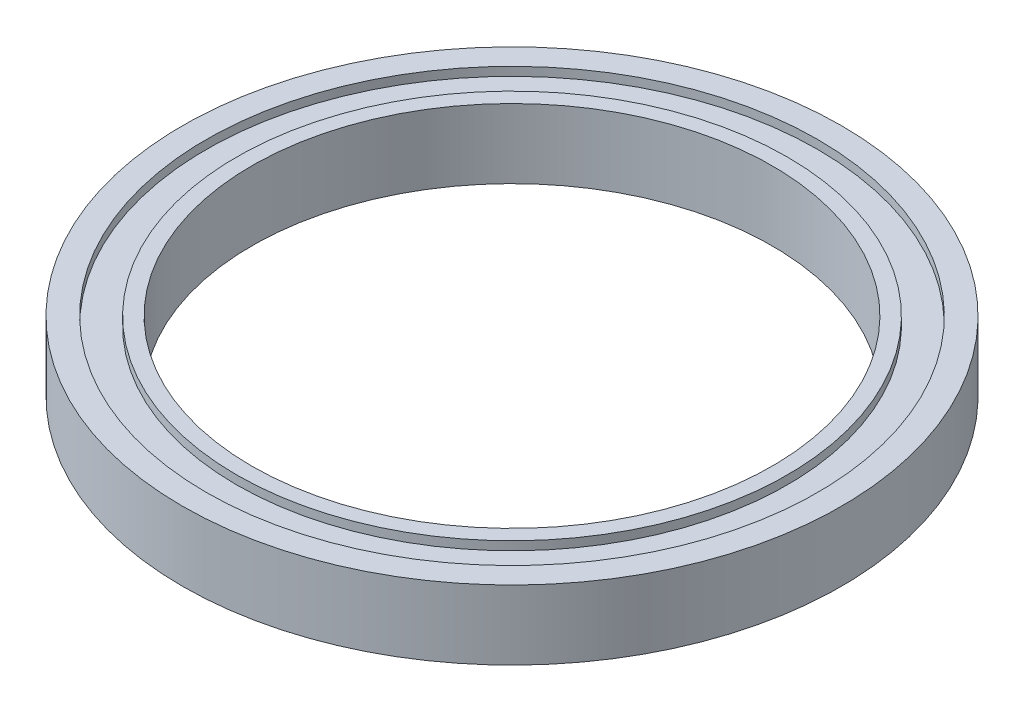
ISO-10303-21;
HEADER;
FILE_DESCRIPTION(('STEP AP214'),'2;1');
FILE_NAME('part.step','',(''),(''),'','','');
FILE_SCHEMA(('AUTOMOTIVE_DESIGN { 1 0 10303 214 1 1 1 1 }'));
ENDSEC;
DATA;
#1=APPLICATION_CONTEXT('core data for automotive mechanical design processes');
#2=APPLICATION_PROTOCOL_DEFINITION('international standard','automotive_design',2000,#1);
#3=PRODUCT_CONTEXT('',#1,'mechanical');
#4=PRODUCT('Part','Part','',(#3));
#5=PRODUCT_RELATED_PRODUCT_CATEGORY('part','',(#4));
#6=PRODUCT_DEFINITION_FORMATION('','',#4);
#7=PRODUCT_DEFINITION_CONTEXT('part definition',#1,'design');
#8=PRODUCT_DEFINITION('design','',#6,#7);
#9=PRODUCT_DEFINITION_SHAPE('','',#8);
#10=(LENGTH_UNIT() NAMED_UNIT(*) SI_UNIT(.MILLI.,.METRE.));
#11=(NAMED_UNIT(*) PLANE_ANGLE_UNIT() SI_UNIT($,.RADIAN.));
#12=(NAMED_UNIT(*) SI_UNIT($,.STERADIAN.) SOLID_ANGLE_UNIT());
#13=UNCERTAINTY_MEASURE_WITH_UNIT(LENGTH_MEASURE(1.E-05),#10,'distance_accuracy_value','');
#14=(GEOMETRIC_REPRESENTATION_CONTEXT(3) GLOBAL_UNCERTAINTY_ASSIGNED_CONTEXT((#13)) GLOBAL_UNIT_ASSIGNED_CONTEXT((#10,
#11,#12)) REPRESENTATION_CONTEXT('',''));
#15=CARTESIAN_POINT('',(0.,0.,0.));
#16=DIRECTION('',(0.,0.,1.));
#17=DIRECTION('',(1.,0.,0.));
#18=AXIS2_PLACEMENT_3D('',#15,#16,#17);
#19=CARTESIAN_POINT('',(0.,0.,0.));
#20=DIRECTION('',(0.,1.,0.));
#21=DIRECTION('',(0.,0.,1.));
#22=AXIS2_PLACEMENT_3D('',#19,#20,#21);
#23=PLANE('',#22);
#24=CARTESIAN_POINT('',(0.,0.,0.));
#25=DIRECTION('',(0.,1.,0.));
#26=DIRECTION('',(0.,0.,1.));
#27=AXIS2_PLACEMENT_3D('',#24,#25,#26);
#28=CIRCLE('',#27,30.);
#29=CARTESIAN_POINT('',(0.,0.,30.));
#30=VERTEX_POINT('',#29);
#31=EDGE_CURVE('E47',#30,#30,#28,.T.);
#32=ORIENTED_EDGE('',*,*,#31,.T.);
#33=EDGE_LOOP('',(#32));
#34=FACE_BOUND('',#33,.T.);
#35=CARTESIAN_POINT('',(0.,0.,0.));
#36=DIRECTION('',(0.,-1.,0.));
#37=DIRECTION('',(0.,0.,-1.));
#38=AXIS2_PLACEMENT_3D('',#35,#36,#37);
#39=CIRCLE('',#38,31.75);
#40=CARTESIAN_POINT('',(0.,0.,-31.75));
#41=VERTEX_POINT('',#40);
#42=EDGE_CURVE('E71',#41,#41,#39,.T.);
#43=ORIENTED_EDGE('',*,*,#42,.T.);
#44=EDGE_LOOP('',(#43));
#45=FACE_BOUND('',#44,.T.);
#46=ADVANCED_FACE('F34',(#34,#45),#23,.F.);
#47=CARTESIAN_POINT('',(0.,8.,0.));
#48=DIRECTION('',(0.,1.,0.));
#49=DIRECTION('',(0.,0.,1.));
#50=AXIS2_PLACEMENT_3D('',#47,#48,#49);
#51=PLANE('',#50);
#52=CARTESIAN_POINT('',(0.,8.,0.));
#53=DIRECTION('',(0.,1.,0.));
#54=DIRECTION('',(0.,0.,1.));
#55=AXIS2_PLACEMENT_3D('',#52,#53,#54);
#56=CIRCLE('',#55,30.);
#57=CARTESIAN_POINT('',(0.,8.,30.));
#58=VERTEX_POINT('',#57);
#59=EDGE_CURVE('E45',#58,#58,#56,.T.);
#60=ORIENTED_EDGE('',*,*,#59,.F.);
#61=EDGE_LOOP('',(#60));
#62=FACE_BOUND('',#61,.T.);
#63=CARTESIAN_POINT('',(0.,8.,0.));
#64=DIRECTION('',(0.,1.,0.));
#65=DIRECTION('',(0.,0.,1.));
#66=AXIS2_PLACEMENT_3D('',#63,#64,#65);
#67=CIRCLE('',#66,31.75);
#68=CARTESIAN_POINT('',(0.,8.,31.75));
#69=VERTEX_POINT('',#68);
#70=EDGE_CURVE('E59',#69,#69,#67,.T.);
#71=ORIENTED_EDGE('',*,*,#70,.T.);
#72=EDGE_LOOP('',(#71));
#73=FACE_BOUND('',#72,.T.);
#74=ADVANCED_FACE('F109',(#62,#73),#51,.T.);
#75=CARTESIAN_POINT('',(0.,8.,0.));
#76=DIRECTION('',(0.,1.,0.));
#77=DIRECTION('',(0.,0.,1.));
#78=AXIS2_PLACEMENT_3D('',#75,#76,#77);
#79=CIRCLE('',#78,35.25);
#80=CARTESIAN_POINT('',(0.,8.,35.25));
#81=VERTEX_POINT('',#80);
#82=EDGE_CURVE('E53',#81,#81,#79,.T.);
#83=ORIENTED_EDGE('',*,*,#82,.F.);
#84=EDGE_LOOP('',(#83));
#85=FACE_BOUND('',#84,.T.);
#86=CARTESIAN_POINT('',(0.,8.,0.));
#87=DIRECTION('',(0.,1.,0.));
#88=DIRECTION('',(0.,0.,1.));
#89=AXIS2_PLACEMENT_3D('',#86,#87,#88);
#90=CIRCLE('',#89,38.);
#91=CARTESIAN_POINT('',(0.,8.,38.));
#92=VERTEX_POINT('',#91);
#93=EDGE_CURVE('E10',#92,#92,#90,.T.);
#94=ORIENTED_EDGE('',*,*,#93,.T.);
#95=EDGE_LOOP('',(#94));
#96=FACE_BOUND('',#95,.T.);
#97=ADVANCED_FACE('F96',(#85,#96),#51,.T.);
#98=CARTESIAN_POINT('',(0.,0.,0.));
#99=DIRECTION('',(0.,-1.,0.));
#100=DIRECTION('',(0.,0.,-1.));
#101=AXIS2_PLACEMENT_3D('',#98,#99,#100);
#102=CIRCLE('',#101,35.25);
#103=CARTESIAN_POINT('',(0.,0.,-35.25));
#104=VERTEX_POINT('',#103);
#105=EDGE_CURVE('E65',#104,#104,#102,.T.);
#106=ORIENTED_EDGE('',*,*,#105,.F.);
#107=EDGE_LOOP('',(#106));
#108=FACE_BOUND('',#107,.T.);
#109=CARTESIAN_POINT('',(0.,0.,0.));
#110=DIRECTION('',(0.,1.,0.));
#111=DIRECTION('',(0.,0.,1.));
#112=AXIS2_PLACEMENT_3D('',#109,#110,#111);
#113=CIRCLE('',#112,38.);
#114=CARTESIAN_POINT('',(0.,0.,38.));
#115=VERTEX_POINT('',#114);
#116=EDGE_CURVE('E38',#115,#115,#113,.T.);
#117=ORIENTED_EDGE('',*,*,#116,.F.);
#118=EDGE_LOOP('',(#117));
#119=FACE_BOUND('',#118,.T.);
#120=ADVANCED_FACE('F93',(#108,#119),#23,.F.);
#121=CARTESIAN_POINT('',(0.,8.,0.));
#122=DIRECTION('',(0.,-1.,0.));
#123=DIRECTION('',(0.,0.,-1.));
#124=AXIS2_PLACEMENT_3D('',#121,#122,#123);
#125=CYLINDRICAL_SURFACE('',#124,38.);
#126=ORIENTED_EDGE('',*,*,#93,.F.);
#127=EDGE_LOOP('',(#126));
#128=FACE_BOUND('',#127,.T.);
#129=ORIENTED_EDGE('',*,*,#116,.T.);
#130=EDGE_LOOP('',(#129));
#131=FACE_BOUND('',#130,.T.);
#132=ADVANCED_FACE('F36',(#128,#131),#125,.T.);
#133=CARTESIAN_POINT('',(0.,8.,0.));
#134=DIRECTION('',(0.,-1.,0.));
#135=DIRECTION('',(0.,0.,-1.));
#136=AXIS2_PLACEMENT_3D('',#133,#134,#135);
#137=CYLINDRICAL_SURFACE('',#136,30.);
#138=ORIENTED_EDGE('',*,*,#59,.T.);
#139=EDGE_LOOP('',(#138));
#140=FACE_BOUND('',#139,.T.);
#141=ORIENTED_EDGE('',*,*,#31,.F.);
#142=EDGE_LOOP('',(#141));
#143=FACE_BOUND('',#142,.T.);
#144=ADVANCED_FACE('F100',(#140,#143),#137,.F.);
#145=CARTESIAN_POINT('',(0.,7.,0.));
#146=DIRECTION('',(0.,1.,0.));
#147=DIRECTION('',(0.,0.,1.));
#148=AXIS2_PLACEMENT_3D('',#145,#146,#147);
#149=CYLINDRICAL_SURFACE('',#148,35.25);
#150=CARTESIAN_POINT('',(0.,7.,0.));
#151=DIRECTION('',(0.,1.,0.));
#152=DIRECTION('',(0.,0.,1.));
#153=AXIS2_PLACEMENT_3D('',#150,#151,#152);
#154=CIRCLE('',#153,35.25);
#155=CARTESIAN_POINT('',(0.,7.,35.25));
#156=VERTEX_POINT('',#155);
#157=EDGE_CURVE('E50',#156,#156,#154,.T.);
#158=ORIENTED_EDGE('',*,*,#157,.F.);
#159=EDGE_LOOP('',(#158));
#160=FACE_BOUND('',#159,.T.);
#161=ORIENTED_EDGE('',*,*,#82,.T.);
#162=EDGE_LOOP('',(#161));
#163=FACE_BOUND('',#162,.T.);
#164=ADVANCED_FACE('F105',(#160,#163),#149,.F.);
#165=CARTESIAN_POINT('',(0.,7.,0.));
#166=DIRECTION('',(0.,1.,0.));
#167=DIRECTION('',(0.,0.,1.));
#168=AXIS2_PLACEMENT_3D('',#165,#166,#167);
#169=PLANE('',#168);
#170=CARTESIAN_POINT('',(0.,7.,0.));
#171=DIRECTION('',(0.,1.,0.));
#172=DIRECTION('',(0.,0.,1.));
#173=AXIS2_PLACEMENT_3D('',#170,#171,#172);
#174=CIRCLE('',#173,31.75);
#175=CARTESIAN_POINT('',(0.,7.,31.75));
#176=VERTEX_POINT('',#175);
#177=EDGE_CURVE('E56',#176,#176,#174,.T.);
#178=ORIENTED_EDGE('',*,*,#177,.F.);
#179=EDGE_LOOP('',(#178));
#180=FACE_BOUND('',#179,.T.);
#181=ORIENTED_EDGE('',*,*,#157,.T.);
#182=EDGE_LOOP('',(#181));
#183=FACE_BOUND('',#182,.T.);
#184=ADVANCED_FACE('F122',(#180,#183),#169,.T.);
#185=CARTESIAN_POINT('',(0.,7.,0.));
#186=DIRECTION('',(0.,1.,0.));
#187=DIRECTION('',(0.,0.,1.));
#188=AXIS2_PLACEMENT_3D('',#185,#186,#187);
#189=CYLINDRICAL_SURFACE('',#188,31.75);
#190=ORIENTED_EDGE('',*,*,#177,.T.);
#191=EDGE_LOOP('',(#190));
#192=FACE_BOUND('',#191,.T.);
#193=ORIENTED_EDGE('',*,*,#70,.F.);
#194=EDGE_LOOP('',(#193));
#195=FACE_BOUND('',#194,.T.);
#196=ADVANCED_FACE('F89',(#192,#195),#189,.T.);
#197=CARTESIAN_POINT('',(0.,1.,0.));
#198=DIRECTION('',(0.,-1.,0.));
#199=DIRECTION('',(0.,0.,-1.));
#200=AXIS2_PLACEMENT_3D('',#197,#198,#199);
#201=CYLINDRICAL_SURFACE('',#200,35.25);
#202=CARTESIAN_POINT('',(0.,1.,0.));
#203=DIRECTION('',(0.,-1.,0.));
#204=DIRECTION('',(0.,0.,-1.));
#205=AXIS2_PLACEMENT_3D('',#202,#203,#204);
#206=CIRCLE('',#205,35.25);
#207=CARTESIAN_POINT('',(0.,1.,-35.25));
#208=VERTEX_POINT('',#207);
#209=EDGE_CURVE('E62',#208,#208,#206,.T.);
#210=ORIENTED_EDGE('',*,*,#209,.F.);
#211=EDGE_LOOP('',(#210));
#212=FACE_BOUND('',#211,.T.);
#213=ORIENTED_EDGE('',*,*,#105,.T.);
#214=EDGE_LOOP('',(#213));
#215=FACE_BOUND('',#214,.T.);
#216=ADVANCED_FACE('F83',(#212,#215),#201,.F.);
#217=CARTESIAN_POINT('',(0.,1.,0.));
#218=DIRECTION('',(0.,-1.,0.));
#219=DIRECTION('',(0.,0.,-1.));
#220=AXIS2_PLACEMENT_3D('',#217,#218,#219);
#221=PLANE('',#220);
#222=CARTESIAN_POINT('',(0.,1.,0.));
#223=DIRECTION('',(0.,-1.,0.));
#224=DIRECTION('',(0.,0.,-1.));
#225=AXIS2_PLACEMENT_3D('',#222,#223,#224);
#226=CIRCLE('',#225,31.75);
#227=CARTESIAN_POINT('',(0.,1.,-31.75));
#228=VERTEX_POINT('',#227);
#229=EDGE_CURVE('E68',#228,#228,#226,.T.);
#230=ORIENTED_EDGE('',*,*,#229,.F.);
#231=EDGE_LOOP('',(#230));
#232=FACE_BOUND('',#231,.T.);
#233=ORIENTED_EDGE('',*,*,#209,.T.);
#234=EDGE_LOOP('',(#233));
#235=FACE_BOUND('',#234,.T.);
#236=ADVANCED_FACE('F80',(#232,#235),#221,.T.);
#237=CARTESIAN_POINT('',(0.,1.,0.));
#238=DIRECTION('',(0.,-1.,0.));
#239=DIRECTION('',(0.,0.,-1.));
#240=AXIS2_PLACEMENT_3D('',#237,#238,#239);
#241=CYLINDRICAL_SURFACE('',#240,31.75);
#242=ORIENTED_EDGE('',*,*,#229,.T.);
#243=EDGE_LOOP('',(#242));
#244=FACE_BOUND('',#243,.T.);
#245=ORIENTED_EDGE('',*,*,#42,.F.);
#246=EDGE_LOOP('',(#245));
#247=FACE_BOUND('',#246,.T.);
#248=ADVANCED_FACE('F77',(#244,#247),#241,.T.);
#249=CLOSED_SHELL('',(#46,#74,#97,#120,#132,#144,#164,#184,#196,#216,#236,#248));
#250=MANIFOLD_SOLID_BREP('B2',#249);
#251=ADVANCED_BREP_SHAPE_REPRESENTATION('',(#18,#250),#14);
#252=SHAPE_DEFINITION_REPRESENTATION(#9,#251);
ENDSEC;
END-ISO-10303-21;
